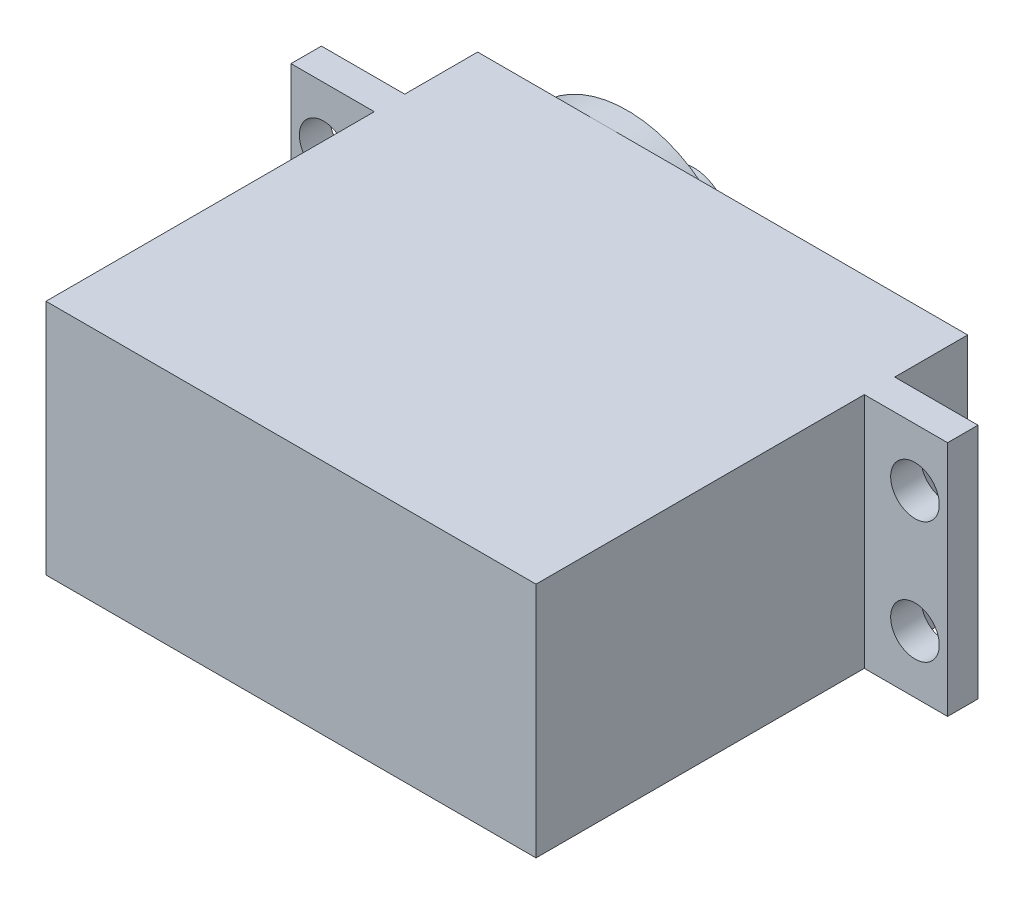
ISO-10303-21;
HEADER;
FILE_DESCRIPTION(('STEP AP214'),'2;1');
FILE_NAME('part.step','',(''),(''),'','','');
FILE_SCHEMA(('AUTOMOTIVE_DESIGN { 1 0 10303 214 1 1 1 1 }'));
ENDSEC;
DATA;
#1=APPLICATION_CONTEXT('core data for automotive mechanical design processes');
#2=APPLICATION_PROTOCOL_DEFINITION('international standard','automotive_design',2000,#1);
#3=PRODUCT_CONTEXT('',#1,'mechanical');
#4=PRODUCT('Part','Part','',(#3));
#5=PRODUCT_RELATED_PRODUCT_CATEGORY('part','',(#4));
#6=PRODUCT_DEFINITION_FORMATION('','',#4);
#7=PRODUCT_DEFINITION_CONTEXT('part definition',#1,'design');
#8=PRODUCT_DEFINITION('design','',#6,#7);
#9=PRODUCT_DEFINITION_SHAPE('','',#8);
#10=(LENGTH_UNIT() NAMED_UNIT(*) SI_UNIT(.MILLI.,.METRE.));
#11=(NAMED_UNIT(*) PLANE_ANGLE_UNIT() SI_UNIT($,.RADIAN.));
#12=(NAMED_UNIT(*) SI_UNIT($,.STERADIAN.) SOLID_ANGLE_UNIT());
#13=UNCERTAINTY_MEASURE_WITH_UNIT(LENGTH_MEASURE(1.E-05),#10,'distance_accuracy_value','');
#14=(GEOMETRIC_REPRESENTATION_CONTEXT(3) GLOBAL_UNCERTAINTY_ASSIGNED_CONTEXT((#13)) GLOBAL_UNIT_ASSIGNED_CONTEXT((#10,
#11,#12)) REPRESENTATION_CONTEXT('',''));
#15=CARTESIAN_POINT('',(0.,0.,0.));
#16=DIRECTION('',(0.,0.,1.));
#17=DIRECTION('',(1.,0.,0.));
#18=AXIS2_PLACEMENT_3D('',#15,#16,#17);
#19=CARTESIAN_POINT('',(0.,0.,-8.5));
#20=DIRECTION('',(0.,0.,1.));
#21=DIRECTION('',(1.,0.,0.));
#22=AXIS2_PLACEMENT_3D('',#19,#20,#21);
#23=PLANE('',#22);
#24=CARTESIAN_POINT('',(-9.85,0.,-8.5));
#25=DIRECTION('',(0.,0.,-1.));
#26=DIRECTION('',(-1.,0.,0.));
#27=AXIS2_PLACEMENT_3D('',#24,#25,#26);
#28=CIRCLE('',#27,9.75000000000001);
#29=CARTESIAN_POINT('',(-3.77405297065978,-7.6253109901598,-8.5));
#30=VERTEX_POINT('',#29);
#31=CARTESIAN_POINT('',(-9.85,-9.75,-8.5));
#32=VERTEX_POINT('',#31);
#33=EDGE_CURVE('E61',#30,#32,#28,.T.);
#34=ORIENTED_EDGE('',*,*,#33,.F.);
#35=DIRECTION('',(-1.,0.,0.));
#36=VECTOR('',#35,1.);
#37=CARTESIAN_POINT('',(0.,-7.6253109901598,-8.5));
#38=LINE('',#37,#36);
#39=CARTESIAN_POINT('',(15.2110908672718,-7.6253109901598,-8.5));
#40=VERTEX_POINT('',#39);
#41=EDGE_CURVE('E65',#40,#30,#38,.T.);
#42=ORIENTED_EDGE('',*,*,#41,.F.);
#43=DIRECTION('',(0.,-1.,0.));
#44=VECTOR('',#43,1.);
#45=CARTESIAN_POINT('',(15.2110908672718,0.,-8.5));
#46=LINE('',#45,#44);
#47=CARTESIAN_POINT('',(15.2110908672718,7.6253109901598,-8.5));
#48=VERTEX_POINT('',#47);
#49=EDGE_CURVE('E369',#48,#40,#46,.T.);
#50=ORIENTED_EDGE('',*,*,#49,.F.);
#51=DIRECTION('',(1.,0.,0.));
#52=VECTOR('',#51,1.);
#53=CARTESIAN_POINT('',(0.,7.6253109901598,-8.5));
#54=LINE('',#53,#52);
#55=CARTESIAN_POINT('',(-3.77405297065978,7.6253109901598,-8.5));
#56=VERTEX_POINT('',#55);
#57=EDGE_CURVE('E365',#56,#48,#54,.T.);
#58=ORIENTED_EDGE('',*,*,#57,.F.);
#59=CARTESIAN_POINT('',(-9.85,9.75,-8.5));
#60=VERTEX_POINT('',#59);
#61=EDGE_CURVE('E190',#60,#56,#28,.T.);
#62=ORIENTED_EDGE('',*,*,#61,.F.);
#63=DIRECTION('',(1.,0.,0.));
#64=VECTOR('',#63,1.);
#65=CARTESIAN_POINT('',(-20.15,9.75000000000001,-8.5));
#66=LINE('',#65,#64);
#67=CARTESIAN_POINT('',(20.15,9.75,-8.5));
#68=VERTEX_POINT('',#67);
#69=EDGE_CURVE('E214',#60,#68,#66,.T.);
#70=ORIENTED_EDGE('',*,*,#69,.T.);
#71=DIRECTION('',(0.,-1.,0.));
#72=VECTOR('',#71,1.);
#73=CARTESIAN_POINT('',(20.15,9.75,-8.5));
#74=LINE('',#73,#72);
#75=CARTESIAN_POINT('',(20.15,-9.75,-8.5));
#76=VERTEX_POINT('',#75);
#77=EDGE_CURVE('E203',#68,#76,#74,.T.);
#78=ORIENTED_EDGE('',*,*,#77,.T.);
#79=DIRECTION('',(-1.,0.,0.));
#80=VECTOR('',#79,1.);
#81=CARTESIAN_POINT('',(-20.15,-9.75,-8.5));
#82=LINE('',#81,#80);
#83=EDGE_CURVE('E208',#76,#32,#82,.T.);
#84=ORIENTED_EDGE('',*,*,#83,.T.);
#85=EDGE_LOOP('',(#34,#42,#50,#58,#62,#70,#78,#84));
#86=FACE_BOUND('',#85,.T.);
#87=ADVANCED_FACE('F43',(#86),#23,.F.);
#88=EDGE_CURVE('E359',#32,#60,#28,.T.);
#89=ORIENTED_EDGE('',*,*,#88,.F.);
#90=CARTESIAN_POINT('',(-20.15,-9.75,-8.5));
#91=VERTEX_POINT('',#90);
#92=EDGE_CURVE('E207',#32,#91,#82,.T.);
#93=ORIENTED_EDGE('',*,*,#92,.T.);
#94=DIRECTION('',(0.,1.,0.));
#95=VECTOR('',#94,1.);
#96=CARTESIAN_POINT('',(-20.15,9.75000000000001,-8.5));
#97=LINE('',#96,#95);
#98=CARTESIAN_POINT('',(-20.15,9.75000000000001,-8.5));
#99=VERTEX_POINT('',#98);
#100=EDGE_CURVE('E211',#91,#99,#97,.T.);
#101=ORIENTED_EDGE('',*,*,#100,.T.);
#102=EDGE_CURVE('E215',#99,#60,#66,.T.);
#103=ORIENTED_EDGE('',*,*,#102,.T.);
#104=EDGE_LOOP('',(#89,#93,#101,#103));
#105=FACE_BOUND('',#104,.T.);
#106=ADVANCED_FACE('F410',(#105),#23,.F.);
#107=CARTESIAN_POINT('',(0.,0.,-2.5));
#108=DIRECTION('',(0.,0.,-1.));
#109=DIRECTION('',(-1.,0.,0.));
#110=AXIS2_PLACEMENT_3D('',#107,#108,#109);
#111=PLANE('',#110);
#112=DIRECTION('',(0.,-1.,0.));
#113=VECTOR('',#112,1.);
#114=CARTESIAN_POINT('',(20.15,9.75,-2.5));
#115=LINE('',#114,#113);
#116=CARTESIAN_POINT('',(20.15,9.75,-2.5));
#117=VERTEX_POINT('',#116);
#118=CARTESIAN_POINT('',(20.15,-9.75,-2.5));
#119=VERTEX_POINT('',#118);
#120=EDGE_CURVE('E192',#117,#119,#115,.T.);
#121=ORIENTED_EDGE('',*,*,#120,.F.);
#122=DIRECTION('',(1.,0.,0.));
#123=VECTOR('',#122,1.);
#124=CARTESIAN_POINT('',(0.,9.75,-2.5));
#125=LINE('',#124,#123);
#126=CARTESIAN_POINT('',(27.,9.74999999999999,-2.5));
#127=VERTEX_POINT('',#126);
#128=EDGE_CURVE('E252',#117,#127,#125,.T.);
#129=ORIENTED_EDGE('',*,*,#128,.T.);
#130=DIRECTION('',(0.,1.,0.));
#131=VECTOR('',#130,1.);
#132=CARTESIAN_POINT('',(27.,0.,-2.5));
#133=LINE('',#132,#131);
#134=CARTESIAN_POINT('',(27.,-9.75000000000001,-2.5));
#135=VERTEX_POINT('',#134);
#136=EDGE_CURVE('E256',#135,#127,#133,.T.);
#137=ORIENTED_EDGE('',*,*,#136,.F.);
#138=DIRECTION('',(1.,0.,0.));
#139=VECTOR('',#138,1.);
#140=CARTESIAN_POINT('',(0.,-9.75,-2.5));
#141=LINE('',#140,#139);
#142=EDGE_CURVE('E260',#119,#135,#141,.T.);
#143=ORIENTED_EDGE('',*,*,#142,.F.);
#144=EDGE_LOOP('',(#121,#129,#137,#143));
#145=FACE_BOUND('',#144,.T.);
#146=CARTESIAN_POINT('',(24.315,5.00000000000003,-2.5));
#147=DIRECTION('',(0.,0.,-1.));
#148=DIRECTION('',(-1.,0.,0.));
#149=AXIS2_PLACEMENT_3D('',#146,#147,#148);
#150=CIRCLE('',#149,2.);
#151=CARTESIAN_POINT('',(22.315,5.00000000000003,-2.5));
#152=VERTEX_POINT('',#151);
#153=EDGE_CURVE('E269',#152,#152,#150,.F.);
#154=ORIENTED_EDGE('',*,*,#153,.T.);
#155=EDGE_LOOP('',(#154));
#156=FACE_BOUND('',#155,.T.);
#157=CARTESIAN_POINT('',(24.315,-4.99999999999997,-2.5));
#158=DIRECTION('',(0.,0.,-1.));
#159=DIRECTION('',(-1.,0.,0.));
#160=AXIS2_PLACEMENT_3D('',#157,#158,#159);
#161=CIRCLE('',#160,2.);
#162=CARTESIAN_POINT('',(22.315,-4.99999999999997,-2.5));
#163=VERTEX_POINT('',#162);
#164=EDGE_CURVE('E265',#163,#163,#161,.F.);
#165=ORIENTED_EDGE('',*,*,#164,.T.);
#166=EDGE_LOOP('',(#165));
#167=FACE_BOUND('',#166,.T.);
#168=ADVANCED_FACE('F415',(#145,#156,#167),#111,.T.);
#169=CARTESIAN_POINT('',(-20.15,-9.75,27.));
#170=DIRECTION('',(1.,0.,0.));
#171=DIRECTION('',(0.,1.,0.));
#172=AXIS2_PLACEMENT_3D('',#169,#170,#171);
#173=PLANE('',#172);
#174=DIRECTION('',(0.,-1.,0.));
#175=VECTOR('',#174,1.);
#176=CARTESIAN_POINT('',(-20.15,-9.75,0.));
#177=LINE('',#176,#175);
#178=CARTESIAN_POINT('',(-20.15,9.75,0.));
#179=VERTEX_POINT('',#178);
#180=CARTESIAN_POINT('',(-20.15,-9.75,0.));
#181=VERTEX_POINT('',#180);
#182=EDGE_CURVE('E319',#179,#181,#177,.T.);
#183=ORIENTED_EDGE('',*,*,#182,.T.);
#184=DIRECTION('',(0.,0.,-1.));
#185=VECTOR('',#184,1.);
#186=CARTESIAN_POINT('',(-20.15,-9.75,27.));
#187=LINE('',#186,#185);
#188=CARTESIAN_POINT('',(-20.15,-9.75,27.));
#189=VERTEX_POINT('',#188);
#190=EDGE_CURVE('E47',#189,#181,#187,.T.);
#191=ORIENTED_EDGE('',*,*,#190,.F.);
#192=DIRECTION('',(0.,-1.,0.));
#193=VECTOR('',#192,1.);
#194=CARTESIAN_POINT('',(-20.15,-9.75,27.));
#195=LINE('',#194,#193);
#196=CARTESIAN_POINT('',(-20.15,9.75,27.));
#197=VERTEX_POINT('',#196);
#198=EDGE_CURVE('E320',#197,#189,#195,.T.);
#199=ORIENTED_EDGE('',*,*,#198,.F.);
#200=DIRECTION('',(0.,0.,-1.));
#201=VECTOR('',#200,1.);
#202=CARTESIAN_POINT('',(-20.15,9.75,27.));
#203=LINE('',#202,#201);
#204=EDGE_CURVE('E334',#197,#179,#203,.T.);
#205=ORIENTED_EDGE('',*,*,#204,.T.);
#206=EDGE_LOOP('',(#183,#191,#199,#205));
#207=FACE_BOUND('',#206,.T.);
#208=ADVANCED_FACE('F45',(#207),#173,.F.);
#209=CARTESIAN_POINT('',(20.15,-9.75,27.));
#210=DIRECTION('',(0.,1.,0.));
#211=DIRECTION('',(-1.,0.,0.));
#212=AXIS2_PLACEMENT_3D('',#209,#210,#211);
#213=PLANE('',#212);
#214=ORIENTED_EDGE('',*,*,#190,.T.);
#215=DIRECTION('',(1.,0.,0.));
#216=VECTOR('',#215,1.);
#217=CARTESIAN_POINT('',(0.,-9.75,0.));
#218=LINE('',#217,#216);
#219=CARTESIAN_POINT('',(-27.,-9.75,0.));
#220=VERTEX_POINT('',#219);
#221=EDGE_CURVE('E295',#220,#181,#218,.T.);
#222=ORIENTED_EDGE('',*,*,#221,.F.);
#223=DIRECTION('',(0.,0.,1.));
#224=VECTOR('',#223,1.);
#225=CARTESIAN_POINT('',(-27.,-9.75,-2.5));
#226=LINE('',#225,#224);
#227=CARTESIAN_POINT('',(-27.,-9.75,-2.5));
#228=VERTEX_POINT('',#227);
#229=EDGE_CURVE('E273',#228,#220,#226,.T.);
#230=ORIENTED_EDGE('',*,*,#229,.F.);
#231=CARTESIAN_POINT('',(-20.15,-9.75,-2.5));
#232=VERTEX_POINT('',#231);
#233=EDGE_CURVE('E261',#228,#232,#141,.T.);
#234=ORIENTED_EDGE('',*,*,#233,.T.);
#235=DIRECTION('',(0.,0.,1.));
#236=VECTOR('',#235,1.);
#237=CARTESIAN_POINT('',(-20.15,-9.75,-8.5));
#238=LINE('',#237,#236);
#239=EDGE_CURVE('E230',#91,#232,#238,.T.);
#240=ORIENTED_EDGE('',*,*,#239,.F.);
#241=ORIENTED_EDGE('',*,*,#92,.F.);
#242=ORIENTED_EDGE('',*,*,#83,.F.);
#243=DIRECTION('',(0.,0.,1.));
#244=VECTOR('',#243,1.);
#245=CARTESIAN_POINT('',(20.15,-9.75,-8.5));
#246=LINE('',#245,#244);
#247=EDGE_CURVE('E234',#76,#119,#246,.T.);
#248=ORIENTED_EDGE('',*,*,#247,.T.);
#249=ORIENTED_EDGE('',*,*,#142,.T.);
#250=DIRECTION('',(0.,0.,1.));
#251=VECTOR('',#250,1.);
#252=CARTESIAN_POINT('',(27.,-9.75000000000001,-2.5));
#253=LINE('',#252,#251);
#254=CARTESIAN_POINT('',(27.,-9.75000000000001,0.));
#255=VERTEX_POINT('',#254);
#256=EDGE_CURVE('E307',#135,#255,#253,.T.);
#257=ORIENTED_EDGE('',*,*,#256,.T.);
#258=CARTESIAN_POINT('',(20.15,-9.75,0.));
#259=VERTEX_POINT('',#258);
#260=EDGE_CURVE('E294',#259,#255,#218,.T.);
#261=ORIENTED_EDGE('',*,*,#260,.F.);
#262=DIRECTION('',(0.,0.,-1.));
#263=VECTOR('',#262,1.);
#264=CARTESIAN_POINT('',(20.15,-9.75,27.));
#265=LINE('',#264,#263);
#266=CARTESIAN_POINT('',(20.15,-9.75,27.));
#267=VERTEX_POINT('',#266);
#268=EDGE_CURVE('E347',#267,#259,#265,.T.);
#269=ORIENTED_EDGE('',*,*,#268,.F.);
#270=DIRECTION('',(1.,0.,0.));
#271=VECTOR('',#270,1.);
#272=CARTESIAN_POINT('',(20.15,-9.75,27.));
#273=LINE('',#272,#271);
#274=EDGE_CURVE('E324',#189,#267,#273,.T.);
#275=ORIENTED_EDGE('',*,*,#274,.F.);
#276=EDGE_LOOP('',(#214,#222,#230,#234,#240,#241,#242,#248,#249,#257,#261,#269,#275));
#277=FACE_BOUND('',#276,.T.);
#278=ADVANCED_FACE('F471',(#277),#213,.F.);
#279=CARTESIAN_POINT('',(20.15,-9.75,27.));
#280=DIRECTION('',(-1.,0.,0.));
#281=DIRECTION('',(0.,0.,1.));
#282=AXIS2_PLACEMENT_3D('',#279,#280,#281);
#283=PLANE('',#282);
#284=DIRECTION('',(0.,1.,0.));
#285=VECTOR('',#284,1.);
#286=CARTESIAN_POINT('',(20.15,-9.75,0.));
#287=LINE('',#286,#285);
#288=CARTESIAN_POINT('',(20.15,9.75,0.));
#289=VERTEX_POINT('',#288);
#290=EDGE_CURVE('E325',#259,#289,#287,.T.);
#291=ORIENTED_EDGE('',*,*,#290,.T.);
#292=DIRECTION('',(0.,0.,-1.));
#293=VECTOR('',#292,1.);
#294=CARTESIAN_POINT('',(20.15,9.75,27.));
#295=LINE('',#294,#293);
#296=CARTESIAN_POINT('',(20.15,9.75,27.));
#297=VERTEX_POINT('',#296);
#298=EDGE_CURVE('E344',#297,#289,#295,.T.);
#299=ORIENTED_EDGE('',*,*,#298,.F.);
#300=DIRECTION('',(0.,1.,0.));
#301=VECTOR('',#300,1.);
#302=CARTESIAN_POINT('',(20.15,-9.75,27.));
#303=LINE('',#302,#301);
#304=EDGE_CURVE('E328',#267,#297,#303,.T.);
#305=ORIENTED_EDGE('',*,*,#304,.F.);
#306=ORIENTED_EDGE('',*,*,#268,.T.);
#307=EDGE_LOOP('',(#291,#299,#305,#306));
#308=FACE_BOUND('',#307,.T.);
#309=ADVANCED_FACE('F468',(#308),#283,.F.);
#310=CARTESIAN_POINT('',(20.15,9.75,27.));
#311=DIRECTION('',(0.,-1.,0.));
#312=DIRECTION('',(1.,0.,0.));
#313=AXIS2_PLACEMENT_3D('',#310,#311,#312);
#314=PLANE('',#313);
#315=ORIENTED_EDGE('',*,*,#298,.T.);
#316=DIRECTION('',(1.,0.,0.));
#317=VECTOR('',#316,1.);
#318=CARTESIAN_POINT('',(0.,9.75,0.));
#319=LINE('',#318,#317);
#320=CARTESIAN_POINT('',(27.,9.74999999999999,0.));
#321=VERTEX_POINT('',#320);
#322=EDGE_CURVE('E285',#289,#321,#319,.T.);
#323=ORIENTED_EDGE('',*,*,#322,.T.);
#324=DIRECTION('',(0.,0.,1.));
#325=VECTOR('',#324,1.);
#326=CARTESIAN_POINT('',(27.,9.74999999999999,-2.5));
#327=LINE('',#326,#325);
#328=EDGE_CURVE('E311',#127,#321,#327,.T.);
#329=ORIENTED_EDGE('',*,*,#328,.F.);
#330=ORIENTED_EDGE('',*,*,#128,.F.);
#331=DIRECTION('',(0.,0.,1.));
#332=VECTOR('',#331,1.);
#333=CARTESIAN_POINT('',(20.15,9.75,-8.5));
#334=LINE('',#333,#332);
#335=EDGE_CURVE('E218',#68,#117,#334,.T.);
#336=ORIENTED_EDGE('',*,*,#335,.F.);
#337=ORIENTED_EDGE('',*,*,#69,.F.);
#338=ORIENTED_EDGE('',*,*,#102,.F.);
#339=DIRECTION('',(0.,0.,1.));
#340=VECTOR('',#339,1.);
#341=CARTESIAN_POINT('',(-20.15,9.75000000000001,-8.5));
#342=LINE('',#341,#340);
#343=CARTESIAN_POINT('',(-20.15,9.75000000000001,-2.5));
#344=VERTEX_POINT('',#343);
#345=EDGE_CURVE('E226',#99,#344,#342,.T.);
#346=ORIENTED_EDGE('',*,*,#345,.T.);
#347=CARTESIAN_POINT('',(-27.,9.75,-2.5));
#348=VERTEX_POINT('',#347);
#349=EDGE_CURVE('E253',#348,#344,#125,.T.);
#350=ORIENTED_EDGE('',*,*,#349,.F.);
#351=DIRECTION('',(0.,0.,1.));
#352=VECTOR('',#351,1.);
#353=CARTESIAN_POINT('',(-27.,9.75,-2.5));
#354=LINE('',#353,#352);
#355=CARTESIAN_POINT('',(-27.,9.75,0.));
#356=VERTEX_POINT('',#355);
#357=EDGE_CURVE('E315',#348,#356,#354,.T.);
#358=ORIENTED_EDGE('',*,*,#357,.T.);
#359=EDGE_CURVE('E286',#356,#179,#319,.T.);
#360=ORIENTED_EDGE('',*,*,#359,.T.);
#361=ORIENTED_EDGE('',*,*,#204,.F.);
#362=DIRECTION('',(-1.,0.,0.));
#363=VECTOR('',#362,1.);
#364=CARTESIAN_POINT('',(20.15,9.75,27.));
#365=LINE('',#364,#363);
#366=EDGE_CURVE('E331',#297,#197,#365,.T.);
#367=ORIENTED_EDGE('',*,*,#366,.F.);
#368=EDGE_LOOP('',(#315,#323,#329,#330,#336,#337,#338,#346,#350,#358,#360,#361,#367));
#369=FACE_BOUND('',#368,.T.);
#370=ADVANCED_FACE('F464',(#369),#314,.F.);
#371=CARTESIAN_POINT('',(0.,0.,27.));
#372=DIRECTION('',(0.,0.,1.));
#373=DIRECTION('',(1.,0.,0.));
#374=AXIS2_PLACEMENT_3D('',#371,#372,#373);
#375=PLANE('',#374);
#376=ORIENTED_EDGE('',*,*,#198,.T.);
#377=ORIENTED_EDGE('',*,*,#274,.T.);
#378=ORIENTED_EDGE('',*,*,#304,.T.);
#379=ORIENTED_EDGE('',*,*,#366,.T.);
#380=EDGE_LOOP('',(#376,#377,#378,#379));
#381=FACE_BOUND('',#380,.T.);
#382=ADVANCED_FACE('F461',(#381),#375,.T.);
#383=CARTESIAN_POINT('',(0.,0.,0.));
#384=DIRECTION('',(0.,0.,-1.));
#385=DIRECTION('',(-1.,0.,0.));
#386=AXIS2_PLACEMENT_3D('',#383,#384,#385);
#387=PLANE('',#386);
#388=ORIENTED_EDGE('',*,*,#182,.F.);
#389=ORIENTED_EDGE('',*,*,#359,.F.);
#390=DIRECTION('',(0.,1.,0.));
#391=VECTOR('',#390,1.);
#392=CARTESIAN_POINT('',(-27.,0.,0.));
#393=LINE('',#392,#391);
#394=EDGE_CURVE('E281',#220,#356,#393,.T.);
#395=ORIENTED_EDGE('',*,*,#394,.F.);
#396=ORIENTED_EDGE('',*,*,#221,.T.);
#397=EDGE_LOOP('',(#388,#389,#395,#396));
#398=FACE_BOUND('',#397,.T.);
#399=CARTESIAN_POINT('',(-24.315,5.,0.));
#400=DIRECTION('',(0.,0.,-1.));
#401=DIRECTION('',(-1.,0.,0.));
#402=AXIS2_PLACEMENT_3D('',#399,#400,#401);
#403=CIRCLE('',#402,2.);
#404=CARTESIAN_POINT('',(-26.315,5.,0.));
#405=VERTEX_POINT('',#404);
#406=EDGE_CURVE('E277',#405,#405,#403,.T.);
#407=ORIENTED_EDGE('',*,*,#406,.T.);
#408=EDGE_LOOP('',(#407));
#409=FACE_BOUND('',#408,.T.);
#410=CARTESIAN_POINT('',(-24.315,-5.,0.));
#411=DIRECTION('',(0.,0.,-1.));
#412=DIRECTION('',(-1.,0.,0.));
#413=AXIS2_PLACEMENT_3D('',#410,#411,#412);
#414=CIRCLE('',#413,2.);
#415=CARTESIAN_POINT('',(-26.315,-5.,0.));
#416=VERTEX_POINT('',#415);
#417=EDGE_CURVE('E238',#416,#416,#414,.T.);
#418=ORIENTED_EDGE('',*,*,#417,.T.);
#419=EDGE_LOOP('',(#418));
#420=FACE_BOUND('',#419,.T.);
#421=ADVANCED_FACE('F437',(#398,#409,#420),#387,.F.);
#422=CARTESIAN_POINT('',(-27.,0.,-2.5));
#423=DIRECTION('',(1.,0.,0.));
#424=DIRECTION('',(0.,0.,-1.));
#425=AXIS2_PLACEMENT_3D('',#422,#423,#424);
#426=PLANE('',#425);
#427=ORIENTED_EDGE('',*,*,#394,.T.);
#428=ORIENTED_EDGE('',*,*,#357,.F.);
#429=DIRECTION('',(0.,1.,0.));
#430=VECTOR('',#429,1.);
#431=CARTESIAN_POINT('',(-27.,0.,-2.5));
#432=LINE('',#431,#430);
#433=EDGE_CURVE('E248',#228,#348,#432,.T.);
#434=ORIENTED_EDGE('',*,*,#433,.F.);
#435=ORIENTED_EDGE('',*,*,#229,.T.);
#436=EDGE_LOOP('',(#427,#428,#434,#435));
#437=FACE_BOUND('',#436,.T.);
#438=ADVANCED_FACE('F450',(#437),#426,.F.);
#439=CARTESIAN_POINT('',(27.,0.,-2.5));
#440=DIRECTION('',(1.,0.,0.));
#441=DIRECTION('',(0.,0.,-1.));
#442=AXIS2_PLACEMENT_3D('',#439,#440,#441);
#443=PLANE('',#442);
#444=DIRECTION('',(0.,1.,0.));
#445=VECTOR('',#444,1.);
#446=CARTESIAN_POINT('',(27.,0.,0.));
#447=LINE('',#446,#445);
#448=EDGE_CURVE('E290',#255,#321,#447,.T.);
#449=ORIENTED_EDGE('',*,*,#448,.F.);
#450=ORIENTED_EDGE('',*,*,#256,.F.);
#451=ORIENTED_EDGE('',*,*,#136,.T.);
#452=ORIENTED_EDGE('',*,*,#328,.T.);
#453=EDGE_LOOP('',(#449,#450,#451,#452));
#454=FACE_BOUND('',#453,.T.);
#455=ADVANCED_FACE('F446',(#454),#443,.T.);
#456=CARTESIAN_POINT('',(24.315,-4.99999999999997,-2.5));
#457=DIRECTION('',(0.,0.,1.));
#458=DIRECTION('',(1.,0.,0.));
#459=AXIS2_PLACEMENT_3D('',#456,#457,#458);
#460=CYLINDRICAL_SURFACE('',#459,2.);
#461=ORIENTED_EDGE('',*,*,#164,.F.);
#462=EDGE_LOOP('',(#461));
#463=FACE_BOUND('',#462,.T.);
#464=CARTESIAN_POINT('',(24.315,-4.99999999999997,0.));
#465=DIRECTION('',(0.,0.,-1.));
#466=DIRECTION('',(-1.,0.,0.));
#467=AXIS2_PLACEMENT_3D('',#464,#465,#466);
#468=CIRCLE('',#467,2.);
#469=CARTESIAN_POINT('',(22.315,-4.99999999999997,0.));
#470=VERTEX_POINT('',#469);
#471=EDGE_CURVE('E298',#470,#470,#468,.F.);
#472=ORIENTED_EDGE('',*,*,#471,.T.);
#473=EDGE_LOOP('',(#472));
#474=FACE_BOUND('',#473,.T.);
#475=ADVANCED_FACE('F442',(#463,#474),#460,.F.);
#476=CARTESIAN_POINT('',(-24.315,5.,-2.5));
#477=DIRECTION('',(0.,0.,1.));
#478=DIRECTION('',(1.,0.,0.));
#479=AXIS2_PLACEMENT_3D('',#476,#477,#478);
#480=CYLINDRICAL_SURFACE('',#479,2.);
#481=CARTESIAN_POINT('',(-24.315,5.,-2.5));
#482=DIRECTION('',(0.,0.,-1.));
#483=DIRECTION('',(-1.,0.,0.));
#484=AXIS2_PLACEMENT_3D('',#481,#482,#483);
#485=CIRCLE('',#484,2.);
#486=CARTESIAN_POINT('',(-26.315,5.,-2.5));
#487=VERTEX_POINT('',#486);
#488=EDGE_CURVE('E243',#487,#487,#485,.T.);
#489=ORIENTED_EDGE('',*,*,#488,.T.);
#490=EDGE_LOOP('',(#489));
#491=FACE_BOUND('',#490,.T.);
#492=ORIENTED_EDGE('',*,*,#406,.F.);
#493=EDGE_LOOP('',(#492));
#494=FACE_BOUND('',#493,.T.);
#495=ADVANCED_FACE('F445',(#491,#494),#480,.F.);
#496=CARTESIAN_POINT('',(-24.315,-5.,-2.5));
#497=DIRECTION('',(0.,0.,1.));
#498=DIRECTION('',(1.,0.,0.));
#499=AXIS2_PLACEMENT_3D('',#496,#497,#498);
#500=CYLINDRICAL_SURFACE('',#499,2.);
#501=CARTESIAN_POINT('',(-24.315,-5.,-2.5));
#502=DIRECTION('',(0.,0.,-1.));
#503=DIRECTION('',(-1.,0.,0.));
#504=AXIS2_PLACEMENT_3D('',#501,#502,#503);
#505=CIRCLE('',#504,2.);
#506=CARTESIAN_POINT('',(-26.315,-5.,-2.5));
#507=VERTEX_POINT('',#506);
#508=EDGE_CURVE('E239',#507,#507,#505,.T.);
#509=ORIENTED_EDGE('',*,*,#508,.T.);
#510=EDGE_LOOP('',(#509));
#511=FACE_BOUND('',#510,.T.);
#512=ORIENTED_EDGE('',*,*,#417,.F.);
#513=EDGE_LOOP('',(#512));
#514=FACE_BOUND('',#513,.T.);
#515=ADVANCED_FACE('F440',(#511,#514),#500,.F.);
#516=CARTESIAN_POINT('',(24.315,5.00000000000003,-2.5));
#517=DIRECTION('',(0.,0.,1.));
#518=DIRECTION('',(1.,0.,0.));
#519=AXIS2_PLACEMENT_3D('',#516,#517,#518);
#520=CYLINDRICAL_SURFACE('',#519,2.);
#521=ORIENTED_EDGE('',*,*,#153,.F.);
#522=EDGE_LOOP('',(#521));
#523=FACE_BOUND('',#522,.T.);
#524=CARTESIAN_POINT('',(24.315,5.00000000000003,0.));
#525=DIRECTION('',(0.,0.,-1.));
#526=DIRECTION('',(-1.,0.,0.));
#527=AXIS2_PLACEMENT_3D('',#524,#525,#526);
#528=CIRCLE('',#527,2.);
#529=CARTESIAN_POINT('',(22.315,5.00000000000003,0.));
#530=VERTEX_POINT('',#529);
#531=EDGE_CURVE('E244',#530,#530,#528,.F.);
#532=ORIENTED_EDGE('',*,*,#531,.T.);
#533=EDGE_LOOP('',(#532));
#534=FACE_BOUND('',#533,.T.);
#535=ADVANCED_FACE('F432',(#523,#534),#520,.F.);
#536=DIRECTION('',(0.,1.,0.));
#537=VECTOR('',#536,1.);
#538=CARTESIAN_POINT('',(-20.15,9.75000000000001,-2.5));
#539=LINE('',#538,#537);
#540=EDGE_CURVE('E197',#232,#344,#539,.T.);
#541=ORIENTED_EDGE('',*,*,#540,.F.);
#542=ORIENTED_EDGE('',*,*,#233,.F.);
#543=ORIENTED_EDGE('',*,*,#433,.T.);
#544=ORIENTED_EDGE('',*,*,#349,.T.);
#545=EDGE_LOOP('',(#541,#542,#543,#544));
#546=FACE_BOUND('',#545,.T.);
#547=ORIENTED_EDGE('',*,*,#508,.F.);
#548=EDGE_LOOP('',(#547));
#549=FACE_BOUND('',#548,.T.);
#550=ORIENTED_EDGE('',*,*,#488,.F.);
#551=EDGE_LOOP('',(#550));
#552=FACE_BOUND('',#551,.T.);
#553=ADVANCED_FACE('F429',(#546,#549,#552),#111,.T.);
#554=ORIENTED_EDGE('',*,*,#290,.F.);
#555=ORIENTED_EDGE('',*,*,#260,.T.);
#556=ORIENTED_EDGE('',*,*,#448,.T.);
#557=ORIENTED_EDGE('',*,*,#322,.F.);
#558=EDGE_LOOP('',(#554,#555,#556,#557));
#559=FACE_BOUND('',#558,.T.);
#560=ORIENTED_EDGE('',*,*,#471,.F.);
#561=EDGE_LOOP('',(#560));
#562=FACE_BOUND('',#561,.T.);
#563=ORIENTED_EDGE('',*,*,#531,.F.);
#564=EDGE_LOOP('',(#563));
#565=FACE_BOUND('',#564,.T.);
#566=ADVANCED_FACE('F427',(#559,#562,#565),#387,.F.);
#567=CARTESIAN_POINT('',(20.15,9.75,-8.5));
#568=DIRECTION('',(-1.,0.,0.));
#569=DIRECTION('',(0.,-1.,0.));
#570=AXIS2_PLACEMENT_3D('',#567,#568,#569);
#571=PLANE('',#570);
#572=ORIENTED_EDGE('',*,*,#120,.T.);
#573=ORIENTED_EDGE('',*,*,#247,.F.);
#574=ORIENTED_EDGE('',*,*,#77,.F.);
#575=ORIENTED_EDGE('',*,*,#335,.T.);
#576=EDGE_LOOP('',(#572,#573,#574,#575));
#577=FACE_BOUND('',#576,.T.);
#578=ADVANCED_FACE('F423',(#577),#571,.F.);
#579=CARTESIAN_POINT('',(-20.15,9.75000000000001,-8.5));
#580=DIRECTION('',(1.,0.,0.));
#581=DIRECTION('',(0.,1.,0.));
#582=AXIS2_PLACEMENT_3D('',#579,#580,#581);
#583=PLANE('',#582);
#584=ORIENTED_EDGE('',*,*,#540,.T.);
#585=ORIENTED_EDGE('',*,*,#345,.F.);
#586=ORIENTED_EDGE('',*,*,#100,.F.);
#587=ORIENTED_EDGE('',*,*,#239,.T.);
#588=EDGE_LOOP('',(#584,#585,#586,#587));
#589=FACE_BOUND('',#588,.T.);
#590=ADVANCED_FACE('F420',(#589),#583,.F.);
#591=CARTESIAN_POINT('',(-9.85,0.,-10.5));
#592=DIRECTION('',(0.,0.,1.));
#593=DIRECTION('',(1.,0.,0.));
#594=AXIS2_PLACEMENT_3D('',#591,#592,#593);
#595=CYLINDRICAL_SURFACE('',#594,9.75000000000001);
#596=ORIENTED_EDGE('',*,*,#33,.T.);
#597=ORIENTED_EDGE('',*,*,#88,.T.);
#598=ORIENTED_EDGE('',*,*,#61,.T.);
#599=DIRECTION('',(0.,0.,1.));
#600=VECTOR('',#599,1.);
#601=CARTESIAN_POINT('',(-3.77405297065978,7.6253109901598,-10.5));
#602=LINE('',#601,#600);
#603=CARTESIAN_POINT('',(-3.77405297065978,7.6253109901598,-10.5));
#604=VERTEX_POINT('',#603);
#605=EDGE_CURVE('E169',#604,#56,#602,.T.);
#606=ORIENTED_EDGE('',*,*,#605,.F.);
#607=CARTESIAN_POINT('',(-9.85,0.,-10.5));
#608=DIRECTION('',(0.,0.,-1.));
#609=DIRECTION('',(-1.,0.,0.));
#610=AXIS2_PLACEMENT_3D('',#607,#608,#609);
#611=CIRCLE('',#610,9.75000000000001);
#612=CARTESIAN_POINT('',(-3.77405297065978,-7.6253109901598,-10.5));
#613=VERTEX_POINT('',#612);
#614=EDGE_CURVE('E176',#613,#604,#611,.T.);
#615=ORIENTED_EDGE('',*,*,#614,.F.);
#616=DIRECTION('',(0.,0.,1.));
#617=VECTOR('',#616,1.);
#618=CARTESIAN_POINT('',(-3.77405297065978,-7.6253109901598,-10.5));
#619=LINE('',#618,#617);
#620=EDGE_CURVE('E385',#613,#30,#619,.T.);
#621=ORIENTED_EDGE('',*,*,#620,.T.);
#622=EDGE_LOOP('',(#596,#597,#598,#606,#615,#621));
#623=FACE_BOUND('',#622,.T.);
#624=ADVANCED_FACE('F188',(#623),#595,.T.);
#625=CARTESIAN_POINT('',(0.,7.6253109901598,-10.5));
#626=DIRECTION('',(0.,-1.,0.));
#627=DIRECTION('',(0.,0.,-1.));
#628=AXIS2_PLACEMENT_3D('',#625,#626,#627);
#629=PLANE('',#628);
#630=ORIENTED_EDGE('',*,*,#57,.T.);
#631=DIRECTION('',(0.,0.,1.));
#632=VECTOR('',#631,1.);
#633=CARTESIAN_POINT('',(15.2110908672718,7.6253109901598,-10.5));
#634=LINE('',#633,#632);
#635=CARTESIAN_POINT('',(15.2110908672718,7.6253109901598,-10.5));
#636=VERTEX_POINT('',#635);
#637=EDGE_CURVE('E171',#636,#48,#634,.T.);
#638=ORIENTED_EDGE('',*,*,#637,.F.);
#639=DIRECTION('',(1.,0.,0.));
#640=VECTOR('',#639,1.);
#641=CARTESIAN_POINT('',(0.,7.6253109901598,-10.5));
#642=LINE('',#641,#640);
#643=EDGE_CURVE('E164',#604,#636,#642,.T.);
#644=ORIENTED_EDGE('',*,*,#643,.F.);
#645=ORIENTED_EDGE('',*,*,#605,.T.);
#646=EDGE_LOOP('',(#630,#638,#644,#645));
#647=FACE_BOUND('',#646,.T.);
#648=ADVANCED_FACE('F167',(#647),#629,.F.);
#649=CARTESIAN_POINT('',(15.2110908672718,0.,-10.5));
#650=DIRECTION('',(-1.,0.,0.));
#651=DIRECTION('',(0.,0.,1.));
#652=AXIS2_PLACEMENT_3D('',#649,#650,#651);
#653=PLANE('',#652);
#654=ORIENTED_EDGE('',*,*,#49,.T.);
#655=DIRECTION('',(0.,0.,1.));
#656=VECTOR('',#655,1.);
#657=CARTESIAN_POINT('',(15.2110908672718,-7.6253109901598,-10.5));
#658=LINE('',#657,#656);
#659=CARTESIAN_POINT('',(15.2110908672718,-7.6253109901598,-10.5));
#660=VERTEX_POINT('',#659);
#661=EDGE_CURVE('E199',#660,#40,#658,.T.);
#662=ORIENTED_EDGE('',*,*,#661,.F.);
#663=DIRECTION('',(0.,-1.,0.));
#664=VECTOR('',#663,1.);
#665=CARTESIAN_POINT('',(15.2110908672718,0.,-10.5));
#666=LINE('',#665,#664);
#667=EDGE_CURVE('E175',#636,#660,#666,.T.);
#668=ORIENTED_EDGE('',*,*,#667,.F.);
#669=ORIENTED_EDGE('',*,*,#637,.T.);
#670=EDGE_LOOP('',(#654,#662,#668,#669));
#671=FACE_BOUND('',#670,.T.);
#672=ADVANCED_FACE('F396',(#671),#653,.F.);
#673=CARTESIAN_POINT('',(0.,-7.6253109901598,-10.5));
#674=DIRECTION('',(0.,1.,0.));
#675=DIRECTION('',(0.,0.,1.));
#676=AXIS2_PLACEMENT_3D('',#673,#674,#675);
#677=PLANE('',#676);
#678=ORIENTED_EDGE('',*,*,#41,.T.);
#679=ORIENTED_EDGE('',*,*,#620,.F.);
#680=DIRECTION('',(-1.,0.,0.));
#681=VECTOR('',#680,1.);
#682=CARTESIAN_POINT('',(0.,-7.6253109901598,-10.5));
#683=LINE('',#682,#681);
#684=EDGE_CURVE('E181',#660,#613,#683,.T.);
#685=ORIENTED_EDGE('',*,*,#684,.F.);
#686=ORIENTED_EDGE('',*,*,#661,.T.);
#687=EDGE_LOOP('',(#678,#679,#685,#686));
#688=FACE_BOUND('',#687,.T.);
#689=ADVANCED_FACE('F398',(#688),#677,.F.);
#690=CARTESIAN_POINT('',(0.,0.,-10.5));
#691=DIRECTION('',(0.,0.,-1.));
#692=DIRECTION('',(-1.,0.,0.));
#693=AXIS2_PLACEMENT_3D('',#690,#691,#692);
#694=PLANE('',#693);
#695=CARTESIAN_POINT('',(-9.85,0.,-10.5));
#696=DIRECTION('',(0.,0.,-1.));
#697=DIRECTION('',(-1.,0.,0.));
#698=AXIS2_PLACEMENT_3D('',#695,#696,#697);
#699=CIRCLE('',#698,6.);
#700=CARTESIAN_POINT('',(-15.85,0.,-10.5));
#701=VERTEX_POINT('',#700);
#702=EDGE_CURVE('E53',#701,#701,#699,.T.);
#703=ORIENTED_EDGE('',*,*,#702,.F.);
#704=EDGE_LOOP('',(#703));
#705=FACE_BOUND('',#704,.T.);
#706=ORIENTED_EDGE('',*,*,#614,.T.);
#707=ORIENTED_EDGE('',*,*,#643,.T.);
#708=ORIENTED_EDGE('',*,*,#667,.T.);
#709=ORIENTED_EDGE('',*,*,#684,.T.);
#710=EDGE_LOOP('',(#706,#707,#708,#709));
#711=FACE_BOUND('',#710,.T.);
#712=ADVANCED_FACE('F179',(#705,#711),#694,.T.);
#713=CARTESIAN_POINT('',(-9.85,0.,-11.5));
#714=DIRECTION('',(0.,0.,1.));
#715=DIRECTION('',(1.,0.,0.));
#716=AXIS2_PLACEMENT_3D('',#713,#714,#715);
#717=CYLINDRICAL_SURFACE('',#716,6.);
#718=CARTESIAN_POINT('',(-9.85,0.,-11.5));
#719=DIRECTION('',(0.,0.,-1.));
#720=DIRECTION('',(-1.,0.,0.));
#721=AXIS2_PLACEMENT_3D('',#718,#719,#720);
#722=CIRCLE('',#721,6.);
#723=CARTESIAN_POINT('',(-15.85,0.,-11.5));
#724=VERTEX_POINT('',#723);
#725=EDGE_CURVE('E366',#724,#724,#722,.T.);
#726=ORIENTED_EDGE('',*,*,#725,.F.);
#727=EDGE_LOOP('',(#726));
#728=FACE_BOUND('',#727,.T.);
#729=ORIENTED_EDGE('',*,*,#702,.T.);
#730=EDGE_LOOP('',(#729));
#731=FACE_BOUND('',#730,.T.);
#732=ADVANCED_FACE('F405',(#728,#731),#717,.T.);
#733=CARTESIAN_POINT('',(-9.85,0.,-11.5));
#734=DIRECTION('',(0.,0.,-1.));
#735=DIRECTION('',(-1.,0.,0.));
#736=AXIS2_PLACEMENT_3D('',#733,#734,#735);
#737=PLANE('',#736);
#738=CARTESIAN_POINT('',(-9.85,0.,-11.5));
#739=DIRECTION('',(0.,0.,-1.));
#740=DIRECTION('',(-1.,0.,0.));
#741=AXIS2_PLACEMENT_3D('',#738,#739,#740);
#742=CIRCLE('',#741,2.9);
#743=CARTESIAN_POINT('',(-12.75,0.,-11.5));
#744=VERTEX_POINT('',#743);
#745=EDGE_CURVE('E11',#744,#744,#742,.T.);
#746=ORIENTED_EDGE('',*,*,#745,.F.);
#747=EDGE_LOOP('',(#746));
#748=FACE_BOUND('',#747,.T.);
#749=ORIENTED_EDGE('',*,*,#725,.T.);
#750=EDGE_LOOP('',(#749));
#751=FACE_BOUND('',#750,.T.);
#752=ADVANCED_FACE('F612',(#748,#751),#737,.T.);
#753=CARTESIAN_POINT('',(-9.85,0.,-16.));
#754=DIRECTION('',(0.,0.,1.));
#755=DIRECTION('',(1.,0.,0.));
#756=AXIS2_PLACEMENT_3D('',#753,#754,#755);
#757=CYLINDRICAL_SURFACE('',#756,2.9);
#758=CARTESIAN_POINT('',(-9.85,0.,-16.));
#759=DIRECTION('',(0.,0.,-1.));
#760=DIRECTION('',(-1.,0.,0.));
#761=AXIS2_PLACEMENT_3D('',#758,#759,#760);
#762=CIRCLE('',#761,2.9);
#763=CARTESIAN_POINT('',(-12.75,0.,-16.));
#764=VERTEX_POINT('',#763);
#765=EDGE_CURVE('E371',#764,#764,#762,.T.);
#766=ORIENTED_EDGE('',*,*,#765,.F.);
#767=EDGE_LOOP('',(#766));
#768=FACE_BOUND('',#767,.T.);
#769=ORIENTED_EDGE('',*,*,#745,.T.);
#770=EDGE_LOOP('',(#769));
#771=FACE_BOUND('',#770,.T.);
#772=ADVANCED_FACE('F622',(#768,#771),#757,.T.);
#773=CARTESIAN_POINT('',(-9.85,0.,-16.));
#774=DIRECTION('',(0.,0.,-1.));
#775=DIRECTION('',(-1.,0.,0.));
#776=AXIS2_PLACEMENT_3D('',#773,#774,#775);
#777=PLANE('',#776);
#778=CARTESIAN_POINT('',(-9.85,0.,-16.));
#779=DIRECTION('',(0.,0.,-1.));
#780=DIRECTION('',(-1.,0.,0.));
#781=AXIS2_PLACEMENT_3D('',#778,#779,#780);
#782=CIRCLE('',#781,1.5);
#783=CARTESIAN_POINT('',(-11.35,0.,-16.));
#784=VERTEX_POINT('',#783);
#785=EDGE_CURVE('E670',#784,#784,#782,.T.);
#786=ORIENTED_EDGE('',*,*,#785,.F.);
#787=EDGE_LOOP('',(#786));
#788=FACE_BOUND('',#787,.T.);
#789=ORIENTED_EDGE('',*,*,#765,.T.);
#790=EDGE_LOOP('',(#789));
#791=FACE_BOUND('',#790,.T.);
#792=ADVANCED_FACE('F633',(#788,#791),#777,.T.);
#793=CARTESIAN_POINT('',(-9.85,0.,-7.25735931288071));
#794=DIRECTION('',(0.,0.,-1.));
#795=DIRECTION('',(-1.,0.,0.));
#796=AXIS2_PLACEMENT_3D('',#793,#794,#795);
#797=CYLINDRICAL_SURFACE('',#796,1.5);
#798=CARTESIAN_POINT('',(-9.85,0.,-11.5));
#799=DIRECTION('',(0.,0.,-1.));
#800=DIRECTION('',(-1.,0.,0.));
#801=AXIS2_PLACEMENT_3D('',#798,#799,#800);
#802=CIRCLE('',#801,1.5);
#803=CARTESIAN_POINT('',(-11.35,0.,-11.5));
#804=VERTEX_POINT('',#803);
#805=EDGE_CURVE('E377',#804,#804,#802,.F.);
#806=ORIENTED_EDGE('',*,*,#805,.T.);
#807=EDGE_LOOP('',(#806));
#808=FACE_BOUND('',#807,.T.);
#809=ORIENTED_EDGE('',*,*,#785,.T.);
#810=EDGE_LOOP('',(#809));
#811=FACE_BOUND('',#810,.T.);
#812=ADVANCED_FACE('F643',(#808,#811),#797,.F.);
#813=CARTESIAN_POINT('',(-9.85,0.,-11.5));
#814=DIRECTION('',(0.,0.,-1.));
#815=DIRECTION('',(-1.,0.,0.));
#816=AXIS2_PLACEMENT_3D('',#813,#814,#815);
#817=PLANE('',#816);
#818=ORIENTED_EDGE('',*,*,#805,.F.);
#819=EDGE_LOOP('',(#818));
#820=FACE_BOUND('',#819,.T.);
#821=ADVANCED_FACE('F653',(#820),#817,.T.);
#822=CLOSED_SHELL('',(#87,#106,#168,#208,#278,#309,#370,#382,#421,#438,#455,#475,#495,#515,#535,
#553,#566,#578,#590,#624,#648,#672,#689,#712,#732,#752,#772,#792,#812,#821));
#823=MANIFOLD_SOLID_BREP('B2',#822);
#824=ADVANCED_BREP_SHAPE_REPRESENTATION('',(#18,#823),#14);
#825=SHAPE_DEFINITION_REPRESENTATION(#9,#824);
ENDSEC;
END-ISO-10303-21;
